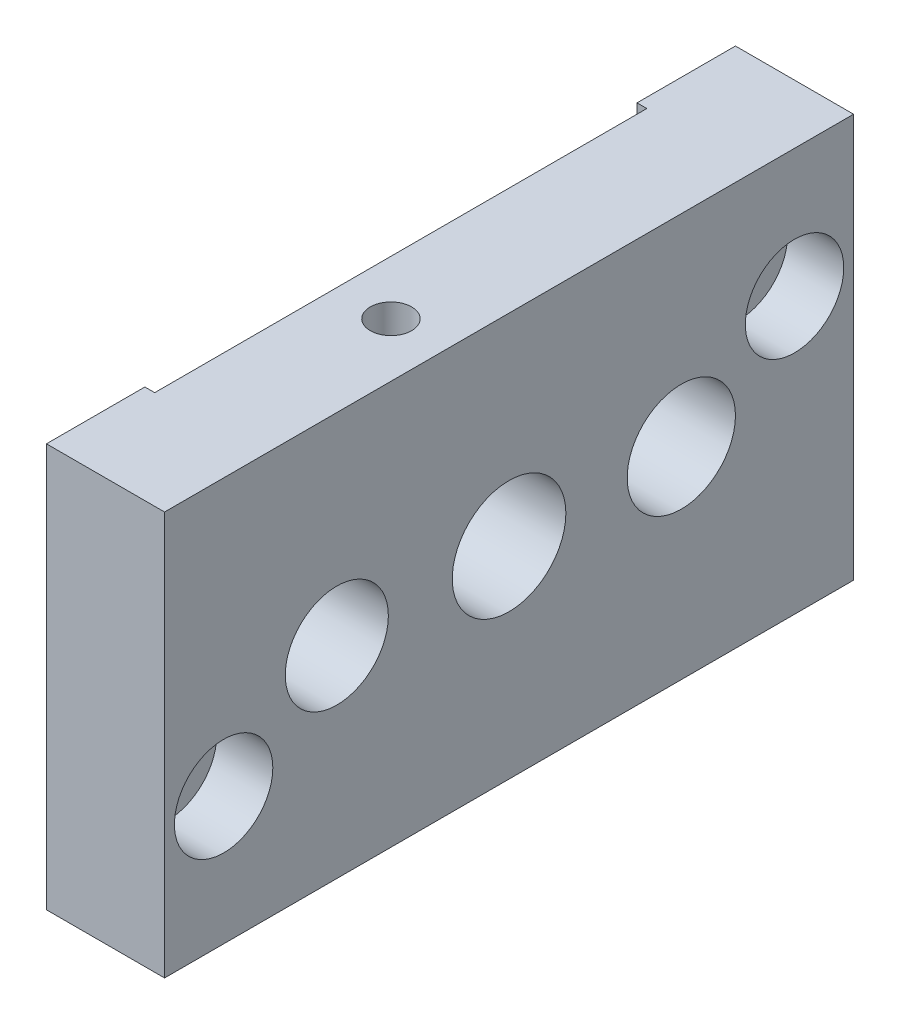
ISO-10303-21;
HEADER;
FILE_DESCRIPTION(('STEP AP214'),'2;1');
FILE_NAME('part.step','',(''),(''),'','','');
FILE_SCHEMA(('AUTOMOTIVE_DESIGN { 1 0 10303 214 1 1 1 1 }'));
ENDSEC;
DATA;
#1=APPLICATION_CONTEXT('core data for automotive mechanical design processes');
#2=APPLICATION_PROTOCOL_DEFINITION('international standard','automotive_design',2000,#1);
#3=PRODUCT_CONTEXT('',#1,'mechanical');
#4=PRODUCT('Part','Part','',(#3));
#5=PRODUCT_RELATED_PRODUCT_CATEGORY('part','',(#4));
#6=PRODUCT_DEFINITION_FORMATION('','',#4);
#7=PRODUCT_DEFINITION_CONTEXT('part definition',#1,'design');
#8=PRODUCT_DEFINITION('design','',#6,#7);
#9=PRODUCT_DEFINITION_SHAPE('','',#8);
#10=(LENGTH_UNIT() NAMED_UNIT(*) SI_UNIT(.MILLI.,.METRE.));
#11=(NAMED_UNIT(*) PLANE_ANGLE_UNIT() SI_UNIT($,.RADIAN.));
#12=(NAMED_UNIT(*) SI_UNIT($,.STERADIAN.) SOLID_ANGLE_UNIT());
#13=UNCERTAINTY_MEASURE_WITH_UNIT(LENGTH_MEASURE(1.E-05),#10,'distance_accuracy_value','');
#14=(GEOMETRIC_REPRESENTATION_CONTEXT(3) GLOBAL_UNCERTAINTY_ASSIGNED_CONTEXT((#13)) GLOBAL_UNIT_ASSIGNED_CONTEXT((#10,
#11,#12)) REPRESENTATION_CONTEXT('',''));
#15=CARTESIAN_POINT('',(0.,0.,0.));
#16=DIRECTION('',(0.,0.,1.));
#17=DIRECTION('',(1.,0.,0.));
#18=AXIS2_PLACEMENT_3D('',#15,#16,#17);
#19=CARTESIAN_POINT('',(-6.,13.,29.));
#20=DIRECTION('',(1.,0.,0.));
#21=DIRECTION('',(0.,0.,-1.));
#22=AXIS2_PLACEMENT_3D('',#19,#20,#21);
#23=CYLINDRICAL_SURFACE('',#22,2.75);
#24=CARTESIAN_POINT('',(-6.,13.,29.));
#25=DIRECTION('',(1.,0.,0.));
#26=DIRECTION('',(0.,0.,-1.));
#27=AXIS2_PLACEMENT_3D('',#24,#25,#26);
#28=CIRCLE('',#27,2.75);
#29=CARTESIAN_POINT('',(-6.,13.,26.25));
#30=VERTEX_POINT('',#29);
#31=EDGE_CURVE('E212',#30,#30,#28,.T.);
#32=ORIENTED_EDGE('',*,*,#31,.F.);
#33=EDGE_LOOP('',(#32));
#34=FACE_BOUND('',#33,.T.);
#35=CARTESIAN_POINT('',(0.300000000000002,13.,29.));
#36=DIRECTION('',(1.,0.,0.));
#37=DIRECTION('',(0.,0.,-1.));
#38=AXIS2_PLACEMENT_3D('',#35,#36,#37);
#39=CIRCLE('',#38,2.75);
#40=CARTESIAN_POINT('',(0.300000000000002,13.,26.25));
#41=VERTEX_POINT('',#40);
#42=EDGE_CURVE('E49',#41,#41,#39,.F.);
#43=ORIENTED_EDGE('',*,*,#42,.F.);
#44=EDGE_LOOP('',(#43));
#45=FACE_BOUND('',#44,.T.);
#46=ADVANCED_FACE('F45',(#34,#45),#23,.F.);
#47=CARTESIAN_POINT('',(-6.,28.,-29.));
#48=DIRECTION('',(1.,0.,0.));
#49=DIRECTION('',(0.,0.,-1.));
#50=AXIS2_PLACEMENT_3D('',#47,#48,#49);
#51=CYLINDRICAL_SURFACE('',#50,2.75);
#52=CARTESIAN_POINT('',(-6.,28.,-29.));
#53=DIRECTION('',(1.,0.,0.));
#54=DIRECTION('',(0.,0.,-1.));
#55=AXIS2_PLACEMENT_3D('',#52,#53,#54);
#56=CIRCLE('',#55,2.75);
#57=CARTESIAN_POINT('',(-6.,28.,-31.75));
#58=VERTEX_POINT('',#57);
#59=EDGE_CURVE('E233',#58,#58,#56,.T.);
#60=ORIENTED_EDGE('',*,*,#59,.F.);
#61=EDGE_LOOP('',(#60));
#62=FACE_BOUND('',#61,.T.);
#63=CARTESIAN_POINT('',(0.300000000000002,28.,-29.));
#64=DIRECTION('',(1.,0.,0.));
#65=DIRECTION('',(0.,0.,-1.));
#66=AXIS2_PLACEMENT_3D('',#63,#64,#65);
#67=CIRCLE('',#66,2.75);
#68=CARTESIAN_POINT('',(0.300000000000002,28.,-31.75));
#69=VERTEX_POINT('',#68);
#70=EDGE_CURVE('E203',#69,#69,#67,.F.);
#71=ORIENTED_EDGE('',*,*,#70,.F.);
#72=EDGE_LOOP('',(#71));
#73=FACE_BOUND('',#72,.T.);
#74=ADVANCED_FACE('F291',(#62,#73),#51,.F.);
#75=CARTESIAN_POINT('',(6.,41.,35.));
#76=DIRECTION('',(-1.,0.,0.));
#77=DIRECTION('',(0.,0.,1.));
#78=AXIS2_PLACEMENT_3D('',#75,#76,#77);
#79=PLANE('',#78);
#80=CARTESIAN_POINT('',(6.,13.,29.));
#81=DIRECTION('',(1.,0.,0.));
#82=DIRECTION('',(0.,0.,-1.));
#83=AXIS2_PLACEMENT_3D('',#80,#81,#82);
#84=CIRCLE('',#83,5.);
#85=CARTESIAN_POINT('',(6.,13.,24.));
#86=VERTEX_POINT('',#85);
#87=EDGE_CURVE('E214',#86,#86,#84,.T.);
#88=ORIENTED_EDGE('',*,*,#87,.F.);
#89=EDGE_LOOP('',(#88));
#90=FACE_BOUND('',#89,.T.);
#91=CARTESIAN_POINT('',(6.,28.,-29.));
#92=DIRECTION('',(1.,0.,0.));
#93=DIRECTION('',(0.,0.,-1.));
#94=AXIS2_PLACEMENT_3D('',#91,#92,#93);
#95=CIRCLE('',#94,5.);
#96=CARTESIAN_POINT('',(6.,28.,-34.));
#97=VERTEX_POINT('',#96);
#98=EDGE_CURVE('E220',#97,#97,#95,.T.);
#99=ORIENTED_EDGE('',*,*,#98,.F.);
#100=EDGE_LOOP('',(#99));
#101=FACE_BOUND('',#100,.T.);
#102=CARTESIAN_POINT('',(6.,20.5,0.));
#103=DIRECTION('',(1.,0.,0.));
#104=DIRECTION('',(0.,0.,-1.));
#105=AXIS2_PLACEMENT_3D('',#102,#103,#104);
#106=CIRCLE('',#105,5.77125277766284);
#107=CARTESIAN_POINT('',(6.,20.5,-5.77125277766284));
#108=VERTEX_POINT('',#107);
#109=EDGE_CURVE('E241',#108,#108,#106,.T.);
#110=ORIENTED_EDGE('',*,*,#109,.F.);
#111=EDGE_LOOP('',(#110));
#112=FACE_BOUND('',#111,.T.);
#113=CARTESIAN_POINT('',(6.,20.5,-17.5));
#114=DIRECTION('',(1.,0.,0.));
#115=DIRECTION('',(0.,0.,-1.));
#116=AXIS2_PLACEMENT_3D('',#113,#114,#115);
#117=CIRCLE('',#116,5.5);
#118=CARTESIAN_POINT('',(6.,20.5,-23.));
#119=VERTEX_POINT('',#118);
#120=EDGE_CURVE('E237',#119,#119,#117,.T.);
#121=ORIENTED_EDGE('',*,*,#120,.F.);
#122=EDGE_LOOP('',(#121));
#123=FACE_BOUND('',#122,.T.);
#124=CARTESIAN_POINT('',(6.,20.5,17.5));
#125=DIRECTION('',(1.,0.,0.));
#126=DIRECTION('',(0.,0.,-1.));
#127=AXIS2_PLACEMENT_3D('',#124,#125,#126);
#128=CIRCLE('',#127,5.23710058908071);
#129=CARTESIAN_POINT('',(6.,20.5,12.2628994109193));
#130=VERTEX_POINT('',#129);
#131=EDGE_CURVE('E197',#130,#130,#128,.T.);
#132=ORIENTED_EDGE('',*,*,#131,.F.);
#133=EDGE_LOOP('',(#132));
#134=FACE_BOUND('',#133,.T.);
#135=DIRECTION('',(0.,0.,-1.));
#136=VECTOR('',#135,1.);
#137=CARTESIAN_POINT('',(6.,0.,35.));
#138=LINE('',#137,#136);
#139=CARTESIAN_POINT('',(6.,0.,35.));
#140=VERTEX_POINT('',#139);
#141=CARTESIAN_POINT('',(6.,0.,-35.));
#142=VERTEX_POINT('',#141);
#143=EDGE_CURVE('E151',#140,#142,#138,.T.);
#144=ORIENTED_EDGE('',*,*,#143,.T.);
#145=DIRECTION('',(0.,-1.,0.));
#146=VECTOR('',#145,1.);
#147=CARTESIAN_POINT('',(6.,41.,-35.));
#148=LINE('',#147,#146);
#149=CARTESIAN_POINT('',(6.,41.,-35.));
#150=VERTEX_POINT('',#149);
#151=EDGE_CURVE('E11',#150,#142,#148,.T.);
#152=ORIENTED_EDGE('',*,*,#151,.F.);
#153=DIRECTION('',(0.,0.,-1.));
#154=VECTOR('',#153,1.);
#155=CARTESIAN_POINT('',(6.,41.,35.));
#156=LINE('',#155,#154);
#157=CARTESIAN_POINT('',(6.,41.,35.));
#158=VERTEX_POINT('',#157);
#159=EDGE_CURVE('E174',#158,#150,#156,.T.);
#160=ORIENTED_EDGE('',*,*,#159,.F.);
#161=DIRECTION('',(0.,-1.,0.));
#162=VECTOR('',#161,1.);
#163=CARTESIAN_POINT('',(6.,41.,35.));
#164=LINE('',#163,#162);
#165=EDGE_CURVE('E147',#158,#140,#164,.T.);
#166=ORIENTED_EDGE('',*,*,#165,.T.);
#167=EDGE_LOOP('',(#144,#152,#160,#166));
#168=FACE_BOUND('',#167,.T.);
#169=ADVANCED_FACE('F47',(#90,#101,#112,#123,#134,#168),#79,.F.);
#170=CARTESIAN_POINT('',(-6.,41.,-35.));
#171=DIRECTION('',(0.,0.,1.));
#172=DIRECTION('',(1.,0.,0.));
#173=AXIS2_PLACEMENT_3D('',#170,#171,#172);
#174=PLANE('',#173);
#175=DIRECTION('',(-1.,0.,0.));
#176=VECTOR('',#175,1.);
#177=CARTESIAN_POINT('',(-6.,0.,-35.));
#178=LINE('',#177,#176);
#179=CARTESIAN_POINT('',(-6.,0.,-35.));
#180=VERTEX_POINT('',#179);
#181=EDGE_CURVE('E155',#142,#180,#178,.T.);
#182=ORIENTED_EDGE('',*,*,#181,.T.);
#183=DIRECTION('',(0.,-1.,0.));
#184=VECTOR('',#183,1.);
#185=CARTESIAN_POINT('',(-6.,41.,-35.));
#186=LINE('',#185,#184);
#187=CARTESIAN_POINT('',(-6.,41.,-35.));
#188=VERTEX_POINT('',#187);
#189=EDGE_CURVE('E56',#188,#180,#186,.T.);
#190=ORIENTED_EDGE('',*,*,#189,.F.);
#191=DIRECTION('',(-1.,0.,0.));
#192=VECTOR('',#191,1.);
#193=CARTESIAN_POINT('',(-6.,41.,-35.));
#194=LINE('',#193,#192);
#195=EDGE_CURVE('E109',#150,#188,#194,.T.);
#196=ORIENTED_EDGE('',*,*,#195,.F.);
#197=ORIENTED_EDGE('',*,*,#151,.T.);
#198=EDGE_LOOP('',(#182,#190,#196,#197));
#199=FACE_BOUND('',#198,.T.);
#200=ADVANCED_FACE('F433',(#199),#174,.F.);
#201=CARTESIAN_POINT('',(-6.,41.,-25.));
#202=DIRECTION('',(1.,0.,0.));
#203=DIRECTION('',(0.,0.,-1.));
#204=AXIS2_PLACEMENT_3D('',#201,#202,#203);
#205=PLANE('',#204);
#206=ORIENTED_EDGE('',*,*,#59,.T.);
#207=EDGE_LOOP('',(#206));
#208=FACE_BOUND('',#207,.T.);
#209=DIRECTION('',(0.,0.,1.));
#210=VECTOR('',#209,1.);
#211=CARTESIAN_POINT('',(-6.,0.,-25.));
#212=LINE('',#211,#210);
#213=CARTESIAN_POINT('',(-6.,0.,-25.));
#214=VERTEX_POINT('',#213);
#215=EDGE_CURVE('E159',#180,#214,#212,.T.);
#216=ORIENTED_EDGE('',*,*,#215,.T.);
#217=DIRECTION('',(0.,-1.,0.));
#218=VECTOR('',#217,1.);
#219=CARTESIAN_POINT('',(-6.,41.,-25.));
#220=LINE('',#219,#218);
#221=CARTESIAN_POINT('',(-6.,41.,-25.));
#222=VERTEX_POINT('',#221);
#223=EDGE_CURVE('E185',#222,#214,#220,.T.);
#224=ORIENTED_EDGE('',*,*,#223,.F.);
#225=DIRECTION('',(0.,0.,1.));
#226=VECTOR('',#225,1.);
#227=CARTESIAN_POINT('',(-6.,41.,-25.));
#228=LINE('',#227,#226);
#229=EDGE_CURVE('E255',#188,#222,#228,.T.);
#230=ORIENTED_EDGE('',*,*,#229,.F.);
#231=ORIENTED_EDGE('',*,*,#189,.T.);
#232=EDGE_LOOP('',(#216,#224,#230,#231));
#233=FACE_BOUND('',#232,.T.);
#234=ADVANCED_FACE('F443',(#208,#233),#205,.F.);
#235=CARTESIAN_POINT('',(-6.,41.,-25.));
#236=DIRECTION('',(0.,0.,-1.));
#237=DIRECTION('',(-1.,0.,0.));
#238=AXIS2_PLACEMENT_3D('',#235,#236,#237);
#239=PLANE('',#238);
#240=DIRECTION('',(1.,0.,0.));
#241=VECTOR('',#240,1.);
#242=CARTESIAN_POINT('',(-6.,0.,-25.));
#243=LINE('',#242,#241);
#244=CARTESIAN_POINT('',(-5.,0.,-25.));
#245=VERTEX_POINT('',#244);
#246=EDGE_CURVE('E162',#214,#245,#243,.T.);
#247=ORIENTED_EDGE('',*,*,#246,.T.);
#248=DIRECTION('',(0.,-1.,0.));
#249=VECTOR('',#248,1.);
#250=CARTESIAN_POINT('',(-5.,41.,-25.));
#251=LINE('',#250,#249);
#252=CARTESIAN_POINT('',(-5.,41.,-25.));
#253=VERTEX_POINT('',#252);
#254=EDGE_CURVE('E181',#253,#245,#251,.T.);
#255=ORIENTED_EDGE('',*,*,#254,.F.);
#256=DIRECTION('',(1.,0.,0.));
#257=VECTOR('',#256,1.);
#258=CARTESIAN_POINT('',(-6.,41.,-25.));
#259=LINE('',#258,#257);
#260=EDGE_CURVE('E258',#222,#253,#259,.T.);
#261=ORIENTED_EDGE('',*,*,#260,.F.);
#262=ORIENTED_EDGE('',*,*,#223,.T.);
#263=EDGE_LOOP('',(#247,#255,#261,#262));
#264=FACE_BOUND('',#263,.T.);
#265=ADVANCED_FACE('F266',(#264),#239,.F.);
#266=CARTESIAN_POINT('',(-5.,41.,-25.));
#267=DIRECTION('',(1.,0.,0.));
#268=DIRECTION('',(0.,0.,-1.));
#269=AXIS2_PLACEMENT_3D('',#266,#267,#268);
#270=PLANE('',#269);
#271=CARTESIAN_POINT('',(-5.,20.5,0.));
#272=DIRECTION('',(1.,0.,0.));
#273=DIRECTION('',(0.,0.,-1.));
#274=AXIS2_PLACEMENT_3D('',#271,#272,#273);
#275=CIRCLE('',#274,5.77125277766284);
#276=CARTESIAN_POINT('',(-5.,20.5,-5.77125277766284));
#277=VERTEX_POINT('',#276);
#278=EDGE_CURVE('E156',#277,#277,#275,.T.);
#279=ORIENTED_EDGE('',*,*,#278,.T.);
#280=EDGE_LOOP('',(#279));
#281=FACE_BOUND('',#280,.T.);
#282=CARTESIAN_POINT('',(-5.,20.5,-17.5));
#283=DIRECTION('',(1.,0.,0.));
#284=DIRECTION('',(0.,0.,-1.));
#285=AXIS2_PLACEMENT_3D('',#282,#283,#284);
#286=CIRCLE('',#285,5.5);
#287=CARTESIAN_POINT('',(-5.,20.5,-23.));
#288=VERTEX_POINT('',#287);
#289=EDGE_CURVE('E196',#288,#288,#286,.T.);
#290=ORIENTED_EDGE('',*,*,#289,.T.);
#291=EDGE_LOOP('',(#290));
#292=FACE_BOUND('',#291,.T.);
#293=CARTESIAN_POINT('',(-4.99999999999999,20.5,17.5));
#294=DIRECTION('',(1.,0.,0.));
#295=DIRECTION('',(0.,0.,-1.));
#296=AXIS2_PLACEMENT_3D('',#293,#294,#295);
#297=CIRCLE('',#296,5.23710058908071);
#298=CARTESIAN_POINT('',(-4.99999999999999,20.5,12.2628994109193));
#299=VERTEX_POINT('',#298);
#300=EDGE_CURVE('E192',#299,#299,#297,.T.);
#301=ORIENTED_EDGE('',*,*,#300,.T.);
#302=EDGE_LOOP('',(#301));
#303=FACE_BOUND('',#302,.T.);
#304=DIRECTION('',(0.,0.,1.));
#305=VECTOR('',#304,1.);
#306=CARTESIAN_POINT('',(-5.,0.,-25.));
#307=LINE('',#306,#305);
#308=CARTESIAN_POINT('',(-4.99999999999999,0.,25.));
#309=VERTEX_POINT('',#308);
#310=EDGE_CURVE('E165',#245,#309,#307,.T.);
#311=ORIENTED_EDGE('',*,*,#310,.T.);
#312=DIRECTION('',(0.,-1.,0.));
#313=VECTOR('',#312,1.);
#314=CARTESIAN_POINT('',(-4.99999999999999,41.,25.));
#315=LINE('',#314,#313);
#316=CARTESIAN_POINT('',(-4.99999999999999,41.,25.));
#317=VERTEX_POINT('',#316);
#318=EDGE_CURVE('E140',#317,#309,#315,.T.);
#319=ORIENTED_EDGE('',*,*,#318,.F.);
#320=DIRECTION('',(0.,0.,1.));
#321=VECTOR('',#320,1.);
#322=CARTESIAN_POINT('',(-5.,41.,-25.));
#323=LINE('',#322,#321);
#324=EDGE_CURVE('E129',#253,#317,#323,.T.);
#325=ORIENTED_EDGE('',*,*,#324,.F.);
#326=ORIENTED_EDGE('',*,*,#254,.T.);
#327=EDGE_LOOP('',(#311,#319,#325,#326));
#328=FACE_BOUND('',#327,.T.);
#329=ADVANCED_FACE('F270',(#281,#292,#303,#328),#270,.F.);
#330=CARTESIAN_POINT('',(-4.99999999999999,41.,25.));
#331=DIRECTION('',(0.,0.,1.));
#332=DIRECTION('',(1.,0.,0.));
#333=AXIS2_PLACEMENT_3D('',#330,#331,#332);
#334=PLANE('',#333);
#335=DIRECTION('',(-1.,0.,0.));
#336=VECTOR('',#335,1.);
#337=CARTESIAN_POINT('',(-4.99999999999999,0.,25.));
#338=LINE('',#337,#336);
#339=CARTESIAN_POINT('',(-6.,0.,25.));
#340=VERTEX_POINT('',#339);
#341=EDGE_CURVE('E138',#309,#340,#338,.T.);
#342=ORIENTED_EDGE('',*,*,#341,.T.);
#343=DIRECTION('',(0.,-1.,0.));
#344=VECTOR('',#343,1.);
#345=CARTESIAN_POINT('',(-6.,41.,25.));
#346=LINE('',#345,#344);
#347=CARTESIAN_POINT('',(-6.,41.,25.));
#348=VERTEX_POINT('',#347);
#349=EDGE_CURVE('E135',#348,#340,#346,.T.);
#350=ORIENTED_EDGE('',*,*,#349,.F.);
#351=DIRECTION('',(-1.,0.,0.));
#352=VECTOR('',#351,1.);
#353=CARTESIAN_POINT('',(-4.99999999999999,41.,25.));
#354=LINE('',#353,#352);
#355=EDGE_CURVE('E123',#317,#348,#354,.T.);
#356=ORIENTED_EDGE('',*,*,#355,.F.);
#357=ORIENTED_EDGE('',*,*,#318,.T.);
#358=EDGE_LOOP('',(#342,#350,#356,#357));
#359=FACE_BOUND('',#358,.T.);
#360=ADVANCED_FACE('F136',(#359),#334,.F.);
#361=CARTESIAN_POINT('',(-6.,41.,35.));
#362=DIRECTION('',(1.,0.,0.));
#363=DIRECTION('',(0.,0.,-1.));
#364=AXIS2_PLACEMENT_3D('',#361,#362,#363);
#365=PLANE('',#364);
#366=ORIENTED_EDGE('',*,*,#31,.T.);
#367=EDGE_LOOP('',(#366));
#368=FACE_BOUND('',#367,.T.);
#369=DIRECTION('',(0.,0.,1.));
#370=VECTOR('',#369,1.);
#371=CARTESIAN_POINT('',(-6.,0.,35.));
#372=LINE('',#371,#370);
#373=CARTESIAN_POINT('',(-6.,0.,35.));
#374=VERTEX_POINT('',#373);
#375=EDGE_CURVE('E95',#340,#374,#372,.T.);
#376=ORIENTED_EDGE('',*,*,#375,.T.);
#377=DIRECTION('',(0.,-1.,0.));
#378=VECTOR('',#377,1.);
#379=CARTESIAN_POINT('',(-6.,41.,35.));
#380=LINE('',#379,#378);
#381=CARTESIAN_POINT('',(-6.,41.,35.));
#382=VERTEX_POINT('',#381);
#383=EDGE_CURVE('E141',#382,#374,#380,.T.);
#384=ORIENTED_EDGE('',*,*,#383,.F.);
#385=DIRECTION('',(0.,0.,1.));
#386=VECTOR('',#385,1.);
#387=CARTESIAN_POINT('',(-6.,41.,35.));
#388=LINE('',#387,#386);
#389=EDGE_CURVE('E127',#348,#382,#388,.T.);
#390=ORIENTED_EDGE('',*,*,#389,.F.);
#391=ORIENTED_EDGE('',*,*,#349,.T.);
#392=EDGE_LOOP('',(#376,#384,#390,#391));
#393=FACE_BOUND('',#392,.T.);
#394=ADVANCED_FACE('F143',(#368,#393),#365,.F.);
#395=CARTESIAN_POINT('',(-6.,41.,35.));
#396=DIRECTION('',(0.,0.,-1.));
#397=DIRECTION('',(-1.,0.,0.));
#398=AXIS2_PLACEMENT_3D('',#395,#396,#397);
#399=PLANE('',#398);
#400=DIRECTION('',(1.,0.,0.));
#401=VECTOR('',#400,1.);
#402=CARTESIAN_POINT('',(-6.,0.,35.));
#403=LINE('',#402,#401);
#404=EDGE_CURVE('E101',#374,#140,#403,.T.);
#405=ORIENTED_EDGE('',*,*,#404,.T.);
#406=ORIENTED_EDGE('',*,*,#165,.F.);
#407=DIRECTION('',(1.,0.,0.));
#408=VECTOR('',#407,1.);
#409=CARTESIAN_POINT('',(-6.,41.,35.));
#410=LINE('',#409,#408);
#411=EDGE_CURVE('E65',#382,#158,#410,.T.);
#412=ORIENTED_EDGE('',*,*,#411,.F.);
#413=ORIENTED_EDGE('',*,*,#383,.T.);
#414=EDGE_LOOP('',(#405,#406,#412,#413));
#415=FACE_BOUND('',#414,.T.);
#416=ADVANCED_FACE('F278',(#415),#399,.F.);
#417=CARTESIAN_POINT('',(0.,41.,0.));
#418=DIRECTION('',(0.,-1.,0.));
#419=DIRECTION('',(0.,0.,-1.));
#420=AXIS2_PLACEMENT_3D('',#417,#418,#419);
#421=PLANE('',#420);
#422=CARTESIAN_POINT('',(0.500000000000002,41.,6.5));
#423=DIRECTION('',(0.,1.,0.));
#424=DIRECTION('',(0.,0.,1.));
#425=AXIS2_PLACEMENT_3D('',#422,#423,#424);
#426=CIRCLE('',#425,2.09999999999999);
#427=CARTESIAN_POINT('',(0.500000000000002,41.,8.59999999999999));
#428=VERTEX_POINT('',#427);
#429=EDGE_CURVE('E511',#428,#428,#426,.T.);
#430=ORIENTED_EDGE('',*,*,#429,.F.);
#431=EDGE_LOOP('',(#430));
#432=FACE_BOUND('',#431,.T.);
#433=ORIENTED_EDGE('',*,*,#159,.T.);
#434=ORIENTED_EDGE('',*,*,#195,.T.);
#435=ORIENTED_EDGE('',*,*,#229,.T.);
#436=ORIENTED_EDGE('',*,*,#260,.T.);
#437=ORIENTED_EDGE('',*,*,#324,.T.);
#438=ORIENTED_EDGE('',*,*,#355,.T.);
#439=ORIENTED_EDGE('',*,*,#389,.T.);
#440=ORIENTED_EDGE('',*,*,#411,.T.);
#441=EDGE_LOOP('',(#433,#434,#435,#436,#437,#438,#439,#440));
#442=FACE_BOUND('',#441,.T.);
#443=ADVANCED_FACE('F125',(#432,#442),#421,.F.);
#444=CARTESIAN_POINT('',(0.,0.,0.));
#445=DIRECTION('',(0.,-1.,0.));
#446=DIRECTION('',(0.,0.,-1.));
#447=AXIS2_PLACEMENT_3D('',#444,#445,#446);
#448=PLANE('',#447);
#449=ORIENTED_EDGE('',*,*,#143,.F.);
#450=ORIENTED_EDGE('',*,*,#404,.F.);
#451=ORIENTED_EDGE('',*,*,#375,.F.);
#452=ORIENTED_EDGE('',*,*,#341,.F.);
#453=ORIENTED_EDGE('',*,*,#310,.F.);
#454=ORIENTED_EDGE('',*,*,#246,.F.);
#455=ORIENTED_EDGE('',*,*,#215,.F.);
#456=ORIENTED_EDGE('',*,*,#181,.F.);
#457=EDGE_LOOP('',(#449,#450,#451,#452,#453,#454,#455,#456));
#458=FACE_BOUND('',#457,.T.);
#459=ADVANCED_FACE('F273',(#458),#448,.T.);
#460=CARTESIAN_POINT('',(-6.,20.5,17.5));
#461=DIRECTION('',(1.,0.,0.));
#462=DIRECTION('',(0.,0.,-1.));
#463=AXIS2_PLACEMENT_3D('',#460,#461,#462);
#464=CYLINDRICAL_SURFACE('',#463,5.23710058908071);
#465=ORIENTED_EDGE('',*,*,#131,.T.);
#466=EDGE_LOOP('',(#465));
#467=FACE_BOUND('',#466,.T.);
#468=ORIENTED_EDGE('',*,*,#300,.F.);
#469=EDGE_LOOP('',(#468));
#470=FACE_BOUND('',#469,.T.);
#471=ADVANCED_FACE('F311',(#467,#470),#464,.F.);
#472=CARTESIAN_POINT('',(-6.,20.5,-17.5));
#473=DIRECTION('',(1.,0.,0.));
#474=DIRECTION('',(0.,0.,-1.));
#475=AXIS2_PLACEMENT_3D('',#472,#473,#474);
#476=CYLINDRICAL_SURFACE('',#475,5.5);
#477=ORIENTED_EDGE('',*,*,#120,.T.);
#478=EDGE_LOOP('',(#477));
#479=FACE_BOUND('',#478,.T.);
#480=ORIENTED_EDGE('',*,*,#289,.F.);
#481=EDGE_LOOP('',(#480));
#482=FACE_BOUND('',#481,.T.);
#483=ADVANCED_FACE('F307',(#479,#482),#476,.F.);
#484=CARTESIAN_POINT('',(-6.,20.5,0.));
#485=DIRECTION('',(1.,0.,0.));
#486=DIRECTION('',(0.,0.,-1.));
#487=AXIS2_PLACEMENT_3D('',#484,#485,#486);
#488=CYLINDRICAL_SURFACE('',#487,5.77125277766284);
#489=ORIENTED_EDGE('',*,*,#109,.T.);
#490=EDGE_LOOP('',(#489));
#491=FACE_BOUND('',#490,.T.);
#492=ORIENTED_EDGE('',*,*,#278,.F.);
#493=EDGE_LOOP('',(#492));
#494=FACE_BOUND('',#493,.T.);
#495=ADVANCED_FACE('F303',(#491,#494),#488,.F.);
#496=CARTESIAN_POINT('',(0.300000000000002,28.,-29.));
#497=DIRECTION('',(1.,0.,0.));
#498=DIRECTION('',(0.,0.,-1.));
#499=AXIS2_PLACEMENT_3D('',#496,#497,#498);
#500=PLANE('',#499);
#501=CARTESIAN_POINT('',(0.300000000000002,28.,-29.));
#502=DIRECTION('',(1.,0.,0.));
#503=DIRECTION('',(0.,0.,-1.));
#504=AXIS2_PLACEMENT_3D('',#501,#502,#503);
#505=CIRCLE('',#504,5.);
#506=CARTESIAN_POINT('',(0.300000000000002,28.,-34.));
#507=VERTEX_POINT('',#506);
#508=EDGE_CURVE('E229',#507,#507,#505,.T.);
#509=ORIENTED_EDGE('',*,*,#508,.T.);
#510=EDGE_LOOP('',(#509));
#511=FACE_BOUND('',#510,.T.);
#512=ORIENTED_EDGE('',*,*,#70,.T.);
#513=EDGE_LOOP('',(#512));
#514=FACE_BOUND('',#513,.T.);
#515=ADVANCED_FACE('F306',(#511,#514),#500,.T.);
#516=CARTESIAN_POINT('',(0.300000000000002,28.,-29.));
#517=DIRECTION('',(1.,0.,0.));
#518=DIRECTION('',(0.,0.,-1.));
#519=AXIS2_PLACEMENT_3D('',#516,#517,#518);
#520=CYLINDRICAL_SURFACE('',#519,5.);
#521=ORIENTED_EDGE('',*,*,#508,.F.);
#522=EDGE_LOOP('',(#521));
#523=FACE_BOUND('',#522,.T.);
#524=ORIENTED_EDGE('',*,*,#98,.T.);
#525=EDGE_LOOP('',(#524));
#526=FACE_BOUND('',#525,.T.);
#527=ADVANCED_FACE('F340',(#523,#526),#520,.F.);
#528=CARTESIAN_POINT('',(0.300000000000002,13.,29.));
#529=DIRECTION('',(1.,0.,0.));
#530=DIRECTION('',(0.,0.,-1.));
#531=AXIS2_PLACEMENT_3D('',#528,#529,#530);
#532=PLANE('',#531);
#533=CARTESIAN_POINT('',(0.300000000000002,13.,29.));
#534=DIRECTION('',(1.,0.,0.));
#535=DIRECTION('',(0.,0.,-1.));
#536=AXIS2_PLACEMENT_3D('',#533,#534,#535);
#537=CIRCLE('',#536,5.);
#538=CARTESIAN_POINT('',(0.300000000000002,13.,24.));
#539=VERTEX_POINT('',#538);
#540=EDGE_CURVE('E206',#539,#539,#537,.T.);
#541=ORIENTED_EDGE('',*,*,#540,.T.);
#542=EDGE_LOOP('',(#541));
#543=FACE_BOUND('',#542,.T.);
#544=ORIENTED_EDGE('',*,*,#42,.T.);
#545=EDGE_LOOP('',(#544));
#546=FACE_BOUND('',#545,.T.);
#547=ADVANCED_FACE('F348',(#543,#546),#532,.T.);
#548=CARTESIAN_POINT('',(0.300000000000002,13.,29.));
#549=DIRECTION('',(1.,0.,0.));
#550=DIRECTION('',(0.,0.,-1.));
#551=AXIS2_PLACEMENT_3D('',#548,#549,#550);
#552=CYLINDRICAL_SURFACE('',#551,5.);
#553=ORIENTED_EDGE('',*,*,#540,.F.);
#554=EDGE_LOOP('',(#553));
#555=FACE_BOUND('',#554,.T.);
#556=ORIENTED_EDGE('',*,*,#87,.T.);
#557=EDGE_LOOP('',(#556));
#558=FACE_BOUND('',#557,.T.);
#559=ADVANCED_FACE('F356',(#555,#558),#552,.F.);
#560=CARTESIAN_POINT('',(0.500000000000002,29.,6.5));
#561=DIRECTION('',(0.,1.,0.));
#562=DIRECTION('',(0.,0.,1.));
#563=AXIS2_PLACEMENT_3D('',#560,#561,#562);
#564=CONICAL_SURFACE('',#563,2.1,1.02974425867665);
#565=CARTESIAN_POINT('',(0.499999999999999,27.7381927000421,6.5));
#566=VERTEX_POINT('',#565);
#567=VERTEX_LOOP('',#566);
#568=FACE_BOUND('',#567,.T.);
#569=CARTESIAN_POINT('',(0.500000000000002,29.,6.5));
#570=DIRECTION('',(0.,1.,0.));
#571=DIRECTION('',(0.,0.,1.));
#572=AXIS2_PLACEMENT_3D('',#569,#570,#571);
#573=CIRCLE('',#572,2.1);
#574=CARTESIAN_POINT('',(0.500000000000002,29.,8.6));
#575=VERTEX_POINT('',#574);
#576=EDGE_CURVE('E223',#575,#575,#573,.T.);
#577=ORIENTED_EDGE('',*,*,#576,.T.);
#578=EDGE_LOOP('',(#577));
#579=FACE_BOUND('',#578,.T.);
#580=ADVANCED_FACE('F363',(#568,#579),#564,.F.);
#581=CARTESIAN_POINT('',(0.500000000000002,41.,6.5));
#582=DIRECTION('',(0.,1.,0.));
#583=DIRECTION('',(0.,0.,1.));
#584=AXIS2_PLACEMENT_3D('',#581,#582,#583);
#585=CYLINDRICAL_SURFACE('',#584,2.09999999999999);
#586=ORIENTED_EDGE('',*,*,#576,.F.);
#587=EDGE_LOOP('',(#586));
#588=FACE_BOUND('',#587,.T.);
#589=ORIENTED_EDGE('',*,*,#429,.T.);
#590=EDGE_LOOP('',(#589));
#591=FACE_BOUND('',#590,.T.);
#592=ADVANCED_FACE('F372',(#588,#591),#585,.F.);
#593=CLOSED_SHELL('',(#46,#74,#169,#200,#234,#265,#329,#360,#394,#416,#443,#459,#471,#483,#495,
#515,#527,#547,#559,#580,#592));
#594=MANIFOLD_SOLID_BREP('B2',#593);
#595=ADVANCED_BREP_SHAPE_REPRESENTATION('',(#18,#594),#14);
#596=SHAPE_DEFINITION_REPRESENTATION(#9,#595);
ENDSEC;
END-ISO-10303-21;
